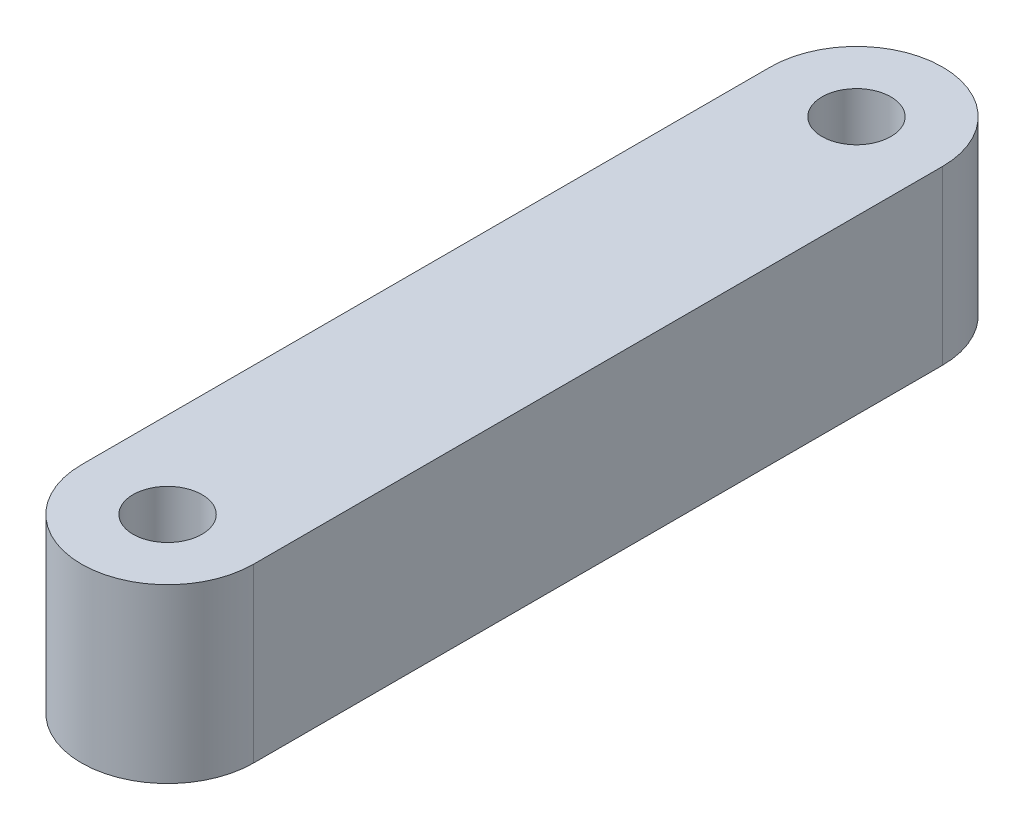
ISO-10303-21;
HEADER;
FILE_DESCRIPTION(('STEP AP214'),'2;1');
FILE_NAME('part.step','',(''),(''),'','','');
FILE_SCHEMA(('AUTOMOTIVE_DESIGN { 1 0 10303 214 1 1 1 1 }'));
ENDSEC;
DATA;
#1=APPLICATION_CONTEXT('core data for automotive mechanical design processes');
#2=APPLICATION_PROTOCOL_DEFINITION('international standard','automotive_design',2000,#1);
#3=PRODUCT_CONTEXT('',#1,'mechanical');
#4=PRODUCT('Part','Part','',(#3));
#5=PRODUCT_RELATED_PRODUCT_CATEGORY('part','',(#4));
#6=PRODUCT_DEFINITION_FORMATION('','',#4);
#7=PRODUCT_DEFINITION_CONTEXT('part definition',#1,'design');
#8=PRODUCT_DEFINITION('design','',#6,#7);
#9=PRODUCT_DEFINITION_SHAPE('','',#8);
#10=(LENGTH_UNIT() NAMED_UNIT(*) SI_UNIT(.MILLI.,.METRE.));
#11=(NAMED_UNIT(*) PLANE_ANGLE_UNIT() SI_UNIT($,.RADIAN.));
#12=(NAMED_UNIT(*) SI_UNIT($,.STERADIAN.) SOLID_ANGLE_UNIT());
#13=UNCERTAINTY_MEASURE_WITH_UNIT(LENGTH_MEASURE(1.E-05),#10,'distance_accuracy_value','');
#14=(GEOMETRIC_REPRESENTATION_CONTEXT(3) GLOBAL_UNCERTAINTY_ASSIGNED_CONTEXT((#13)) GLOBAL_UNIT_ASSIGNED_CONTEXT((#10,
#11,#12)) REPRESENTATION_CONTEXT('',''));
#15=CARTESIAN_POINT('',(0.,0.,0.));
#16=DIRECTION('',(0.,0.,1.));
#17=DIRECTION('',(1.,0.,0.));
#18=AXIS2_PLACEMENT_3D('',#15,#16,#17);
#19=CARTESIAN_POINT('',(5.,10.,0.));
#20=DIRECTION('',(-1.,0.,0.));
#21=DIRECTION('',(0.,0.,1.));
#22=AXIS2_PLACEMENT_3D('',#19,#20,#21);
#23=PLANE('',#22);
#24=DIRECTION('',(0.,0.,-1.));
#25=VECTOR('',#24,1.);
#26=CARTESIAN_POINT('',(5.,0.,0.));
#27=LINE('',#26,#25);
#28=CARTESIAN_POINT('',(5.,0.,0.));
#29=VERTEX_POINT('',#28);
#30=CARTESIAN_POINT('',(5.,0.,-40.));
#31=VERTEX_POINT('',#30);
#32=EDGE_CURVE('E124',#29,#31,#27,.T.);
#33=ORIENTED_EDGE('',*,*,#32,.T.);
#34=DIRECTION('',(0.,-1.,0.));
#35=VECTOR('',#34,1.);
#36=CARTESIAN_POINT('',(5.,10.,-40.));
#37=LINE('',#36,#35);
#38=CARTESIAN_POINT('',(5.,10.,-40.));
#39=VERTEX_POINT('',#38);
#40=EDGE_CURVE('E11',#39,#31,#37,.T.);
#41=ORIENTED_EDGE('',*,*,#40,.F.);
#42=DIRECTION('',(0.,0.,-1.));
#43=VECTOR('',#42,1.);
#44=CARTESIAN_POINT('',(5.,10.,0.));
#45=LINE('',#44,#43);
#46=CARTESIAN_POINT('',(5.,10.,0.));
#47=VERTEX_POINT('',#46);
#48=EDGE_CURVE('E100',#47,#39,#45,.T.);
#49=ORIENTED_EDGE('',*,*,#48,.F.);
#50=DIRECTION('',(0.,-1.,0.));
#51=VECTOR('',#50,1.);
#52=CARTESIAN_POINT('',(5.,10.,0.));
#53=LINE('',#52,#51);
#54=EDGE_CURVE('E112',#47,#29,#53,.T.);
#55=ORIENTED_EDGE('',*,*,#54,.T.);
#56=EDGE_LOOP('',(#33,#41,#49,#55));
#57=FACE_BOUND('',#56,.T.);
#58=ADVANCED_FACE('F47',(#57),#23,.F.);
#59=CARTESIAN_POINT('',(0.,10.,-40.));
#60=DIRECTION('',(0.,-1.,0.));
#61=DIRECTION('',(0.,0.,-1.));
#62=AXIS2_PLACEMENT_3D('',#59,#60,#61);
#63=CYLINDRICAL_SURFACE('',#62,5.);
#64=CARTESIAN_POINT('',(0.,0.,-40.));
#65=DIRECTION('',(0.,1.,0.));
#66=DIRECTION('',(0.,0.,1.));
#67=AXIS2_PLACEMENT_3D('',#64,#65,#66);
#68=CIRCLE('',#67,5.);
#69=CARTESIAN_POINT('',(-5.,0.,-40.));
#70=VERTEX_POINT('',#69);
#71=EDGE_CURVE('E105',#31,#70,#68,.T.);
#72=ORIENTED_EDGE('',*,*,#71,.T.);
#73=DIRECTION('',(0.,-1.,0.));
#74=VECTOR('',#73,1.);
#75=CARTESIAN_POINT('',(-5.,10.,-40.));
#76=LINE('',#75,#74);
#77=CARTESIAN_POINT('',(-5.,10.,-40.));
#78=VERTEX_POINT('',#77);
#79=EDGE_CURVE('E57',#78,#70,#76,.T.);
#80=ORIENTED_EDGE('',*,*,#79,.F.);
#81=CARTESIAN_POINT('',(0.,10.,-40.));
#82=DIRECTION('',(0.,1.,0.));
#83=DIRECTION('',(0.,0.,1.));
#84=AXIS2_PLACEMENT_3D('',#81,#82,#83);
#85=CIRCLE('',#84,5.);
#86=EDGE_CURVE('E95',#39,#78,#85,.T.);
#87=ORIENTED_EDGE('',*,*,#86,.F.);
#88=ORIENTED_EDGE('',*,*,#40,.T.);
#89=EDGE_LOOP('',(#72,#80,#87,#88));
#90=FACE_BOUND('',#89,.T.);
#91=ADVANCED_FACE('F104',(#90),#63,.T.);
#92=CARTESIAN_POINT('',(-5.,10.,0.));
#93=DIRECTION('',(1.,0.,0.));
#94=DIRECTION('',(0.,0.,-1.));
#95=AXIS2_PLACEMENT_3D('',#92,#93,#94);
#96=PLANE('',#95);
#97=DIRECTION('',(0.,0.,1.));
#98=VECTOR('',#97,1.);
#99=CARTESIAN_POINT('',(-5.,0.,0.));
#100=LINE('',#99,#98);
#101=CARTESIAN_POINT('',(-5.,0.,0.));
#102=VERTEX_POINT('',#101);
#103=EDGE_CURVE('E82',#70,#102,#100,.T.);
#104=ORIENTED_EDGE('',*,*,#103,.T.);
#105=DIRECTION('',(0.,-1.,0.));
#106=VECTOR('',#105,1.);
#107=CARTESIAN_POINT('',(-5.,10.,0.));
#108=LINE('',#107,#106);
#109=CARTESIAN_POINT('',(-5.,10.,0.));
#110=VERTEX_POINT('',#109);
#111=EDGE_CURVE('E107',#110,#102,#108,.T.);
#112=ORIENTED_EDGE('',*,*,#111,.F.);
#113=DIRECTION('',(0.,0.,1.));
#114=VECTOR('',#113,1.);
#115=CARTESIAN_POINT('',(-5.,10.,0.));
#116=LINE('',#115,#114);
#117=EDGE_CURVE('E98',#78,#110,#116,.T.);
#118=ORIENTED_EDGE('',*,*,#117,.F.);
#119=ORIENTED_EDGE('',*,*,#79,.T.);
#120=EDGE_LOOP('',(#104,#112,#118,#119));
#121=FACE_BOUND('',#120,.T.);
#122=ADVANCED_FACE('F108',(#121),#96,.F.);
#123=CARTESIAN_POINT('',(0.,10.,-40.));
#124=DIRECTION('',(0.,-1.,0.));
#125=DIRECTION('',(0.,0.,-1.));
#126=AXIS2_PLACEMENT_3D('',#123,#124,#125);
#127=CYLINDRICAL_SURFACE('',#126,2.);
#128=CARTESIAN_POINT('',(0.,10.,-40.));
#129=DIRECTION('',(0.,1.,0.));
#130=DIRECTION('',(0.,0.,1.));
#131=AXIS2_PLACEMENT_3D('',#128,#129,#130);
#132=CIRCLE('',#131,2.);
#133=CARTESIAN_POINT('',(0.,10.,-38.));
#134=VERTEX_POINT('',#133);
#135=EDGE_CURVE('E144',#134,#134,#132,.T.);
#136=ORIENTED_EDGE('',*,*,#135,.T.);
#137=EDGE_LOOP('',(#136));
#138=FACE_BOUND('',#137,.T.);
#139=CARTESIAN_POINT('',(0.,0.,-40.));
#140=DIRECTION('',(0.,1.,0.));
#141=DIRECTION('',(0.,0.,1.));
#142=AXIS2_PLACEMENT_3D('',#139,#140,#141);
#143=CIRCLE('',#142,2.);
#144=CARTESIAN_POINT('',(0.,0.,-38.));
#145=VERTEX_POINT('',#144);
#146=EDGE_CURVE('E120',#145,#145,#143,.T.);
#147=ORIENTED_EDGE('',*,*,#146,.F.);
#148=EDGE_LOOP('',(#147));
#149=FACE_BOUND('',#148,.T.);
#150=ADVANCED_FACE('F160',(#138,#149),#127,.F.);
#151=CARTESIAN_POINT('',(0.,10.,0.));
#152=DIRECTION('',(0.,-1.,0.));
#153=DIRECTION('',(0.,0.,-1.));
#154=AXIS2_PLACEMENT_3D('',#151,#152,#153);
#155=CYLINDRICAL_SURFACE('',#154,2.);
#156=CARTESIAN_POINT('',(0.,10.,0.));
#157=DIRECTION('',(0.,1.,0.));
#158=DIRECTION('',(0.,0.,1.));
#159=AXIS2_PLACEMENT_3D('',#156,#157,#158);
#160=CIRCLE('',#159,2.);
#161=CARTESIAN_POINT('',(0.,10.,2.));
#162=VERTEX_POINT('',#161);
#163=EDGE_CURVE('E134',#162,#162,#160,.T.);
#164=ORIENTED_EDGE('',*,*,#163,.T.);
#165=EDGE_LOOP('',(#164));
#166=FACE_BOUND('',#165,.T.);
#167=CARTESIAN_POINT('',(0.,0.,0.));
#168=DIRECTION('',(0.,1.,0.));
#169=DIRECTION('',(0.,0.,1.));
#170=AXIS2_PLACEMENT_3D('',#167,#168,#169);
#171=CIRCLE('',#170,2.);
#172=CARTESIAN_POINT('',(0.,0.,2.));
#173=VERTEX_POINT('',#172);
#174=EDGE_CURVE('E116',#173,#173,#171,.T.);
#175=ORIENTED_EDGE('',*,*,#174,.F.);
#176=EDGE_LOOP('',(#175));
#177=FACE_BOUND('',#176,.T.);
#178=ADVANCED_FACE('F49',(#166,#177),#155,.F.);
#179=CARTESIAN_POINT('',(0.,10.,0.));
#180=DIRECTION('',(0.,-1.,0.));
#181=DIRECTION('',(0.,0.,-1.));
#182=AXIS2_PLACEMENT_3D('',#179,#180,#181);
#183=CYLINDRICAL_SURFACE('',#182,5.);
#184=CARTESIAN_POINT('',(0.,0.,0.));
#185=DIRECTION('',(0.,1.,0.));
#186=DIRECTION('',(0.,0.,1.));
#187=AXIS2_PLACEMENT_3D('',#184,#185,#186);
#188=CIRCLE('',#187,5.);
#189=EDGE_CURVE('E88',#102,#29,#188,.T.);
#190=ORIENTED_EDGE('',*,*,#189,.T.);
#191=ORIENTED_EDGE('',*,*,#54,.F.);
#192=CARTESIAN_POINT('',(0.,10.,0.));
#193=DIRECTION('',(0.,1.,0.));
#194=DIRECTION('',(0.,0.,1.));
#195=AXIS2_PLACEMENT_3D('',#192,#193,#194);
#196=CIRCLE('',#195,5.);
#197=EDGE_CURVE('E65',#110,#47,#196,.T.);
#198=ORIENTED_EDGE('',*,*,#197,.F.);
#199=ORIENTED_EDGE('',*,*,#111,.T.);
#200=EDGE_LOOP('',(#190,#191,#198,#199));
#201=FACE_BOUND('',#200,.T.);
#202=ADVANCED_FACE('F138',(#201),#183,.T.);
#203=CARTESIAN_POINT('',(0.,10.,0.));
#204=DIRECTION('',(0.,1.,0.));
#205=DIRECTION('',(0.,0.,1.));
#206=AXIS2_PLACEMENT_3D('',#203,#204,#205);
#207=PLANE('',#206);
#208=ORIENTED_EDGE('',*,*,#163,.F.);
#209=EDGE_LOOP('',(#208));
#210=FACE_BOUND('',#209,.T.);
#211=ORIENTED_EDGE('',*,*,#135,.F.);
#212=EDGE_LOOP('',(#211));
#213=FACE_BOUND('',#212,.T.);
#214=ORIENTED_EDGE('',*,*,#48,.T.);
#215=ORIENTED_EDGE('',*,*,#86,.T.);
#216=ORIENTED_EDGE('',*,*,#117,.T.);
#217=ORIENTED_EDGE('',*,*,#197,.T.);
#218=EDGE_LOOP('',(#214,#215,#216,#217));
#219=FACE_BOUND('',#218,.T.);
#220=ADVANCED_FACE('F96',(#210,#213,#219),#207,.T.);
#221=CARTESIAN_POINT('',(0.,0.,0.));
#222=DIRECTION('',(0.,1.,0.));
#223=DIRECTION('',(0.,0.,1.));
#224=AXIS2_PLACEMENT_3D('',#221,#222,#223);
#225=PLANE('',#224);
#226=ORIENTED_EDGE('',*,*,#174,.T.);
#227=EDGE_LOOP('',(#226));
#228=FACE_BOUND('',#227,.T.);
#229=ORIENTED_EDGE('',*,*,#146,.T.);
#230=EDGE_LOOP('',(#229));
#231=FACE_BOUND('',#230,.T.);
#232=ORIENTED_EDGE('',*,*,#32,.F.);
#233=ORIENTED_EDGE('',*,*,#189,.F.);
#234=ORIENTED_EDGE('',*,*,#103,.F.);
#235=ORIENTED_EDGE('',*,*,#71,.F.);
#236=EDGE_LOOP('',(#232,#233,#234,#235));
#237=FACE_BOUND('',#236,.T.);
#238=ADVANCED_FACE('F141',(#228,#231,#237),#225,.F.);
#239=CLOSED_SHELL('',(#58,#91,#122,#150,#178,#202,#220,#238));
#240=MANIFOLD_SOLID_BREP('B2',#239);
#241=ADVANCED_BREP_SHAPE_REPRESENTATION('',(#18,#240),#14);
#242=SHAPE_DEFINITION_REPRESENTATION(#9,#241);
ENDSEC;
END-ISO-10303-21;
